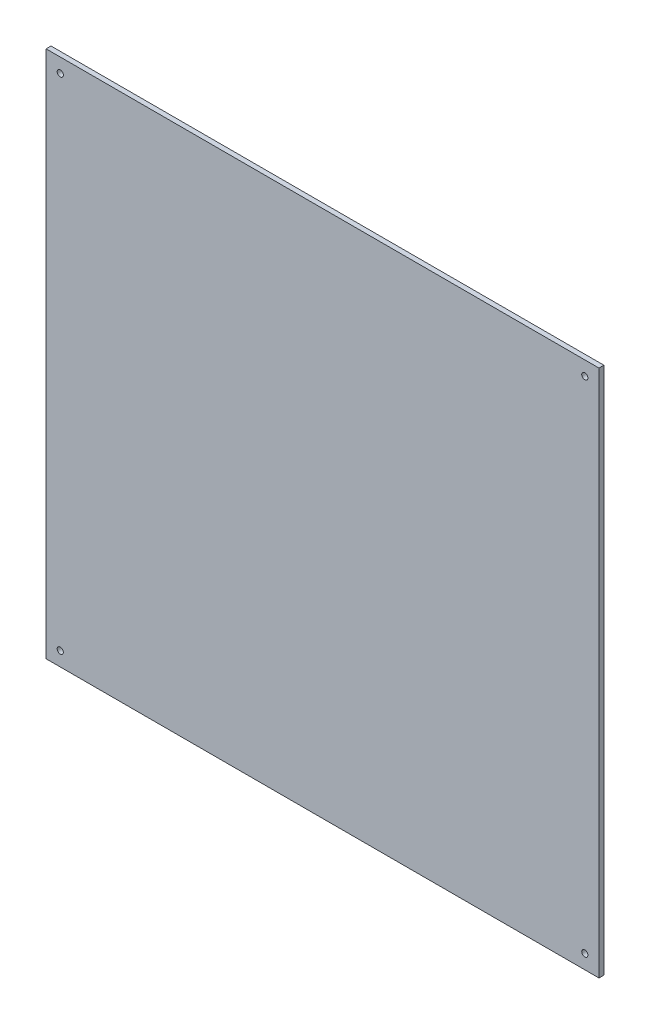
ISO-10303-21;
HEADER;
FILE_DESCRIPTION(('STEP AP214'),'2;1');
FILE_NAME('part.step','',(''),(''),'','','');
FILE_SCHEMA(('AUTOMOTIVE_DESIGN { 1 0 10303 214 1 1 1 1 }'));
ENDSEC;
DATA;
#1=APPLICATION_CONTEXT('core data for automotive mechanical design processes');
#2=APPLICATION_PROTOCOL_DEFINITION('international standard','automotive_design',2000,#1);
#3=PRODUCT_CONTEXT('',#1,'mechanical');
#4=PRODUCT('Part','Part','',(#3));
#5=PRODUCT_RELATED_PRODUCT_CATEGORY('part','',(#4));
#6=PRODUCT_DEFINITION_FORMATION('','',#4);
#7=PRODUCT_DEFINITION_CONTEXT('part definition',#1,'design');
#8=PRODUCT_DEFINITION('design','',#6,#7);
#9=PRODUCT_DEFINITION_SHAPE('','',#8);
#10=(LENGTH_UNIT() NAMED_UNIT(*) SI_UNIT(.MILLI.,.METRE.));
#11=(NAMED_UNIT(*) PLANE_ANGLE_UNIT() SI_UNIT($,.RADIAN.));
#12=(NAMED_UNIT(*) SI_UNIT($,.STERADIAN.) SOLID_ANGLE_UNIT());
#13=UNCERTAINTY_MEASURE_WITH_UNIT(LENGTH_MEASURE(1.E-05),#10,'distance_accuracy_value','');
#14=(GEOMETRIC_REPRESENTATION_CONTEXT(3) GLOBAL_UNCERTAINTY_ASSIGNED_CONTEXT((#13)) GLOBAL_UNIT_ASSIGNED_CONTEXT((#10,
#11,#12)) REPRESENTATION_CONTEXT('',''));
#15=CARTESIAN_POINT('',(0.,0.,0.));
#16=DIRECTION('',(0.,0.,1.));
#17=DIRECTION('',(1.,0.,0.));
#18=AXIS2_PLACEMENT_3D('',#15,#16,#17);
#19=CARTESIAN_POINT('',(0.,0.,4.));
#20=DIRECTION('',(0.,0.,1.));
#21=DIRECTION('',(1.,0.,0.));
#22=AXIS2_PLACEMENT_3D('',#19,#20,#21);
#23=PLANE('',#22);
#24=CARTESIAN_POINT('',(-437.5,11.5000000000001,4.));
#25=DIRECTION('',(0.,0.,1.));
#26=DIRECTION('',(-1.,0.,0.));
#27=AXIS2_PLACEMENT_3D('',#24,#25,#26);
#28=CIRCLE('',#27,2.50000000000002);
#29=CARTESIAN_POINT('',(-440.,11.5000000000001,4.));
#30=VERTEX_POINT('',#29);
#31=EDGE_CURVE('E123',#30,#30,#28,.T.);
#32=ORIENTED_EDGE('',*,*,#31,.F.);
#33=EDGE_LOOP('',(#32));
#34=FACE_BOUND('',#33,.T.);
#35=CARTESIAN_POINT('',(-437.5,417.5,4.));
#36=DIRECTION('',(0.,0.,1.));
#37=DIRECTION('',(1.,0.,0.));
#38=AXIS2_PLACEMENT_3D('',#35,#36,#37);
#39=CIRCLE('',#38,2.50000000000002);
#40=CARTESIAN_POINT('',(-435.,417.5,4.));
#41=VERTEX_POINT('',#40);
#42=EDGE_CURVE('E102',#41,#41,#39,.T.);
#43=ORIENTED_EDGE('',*,*,#42,.F.);
#44=EDGE_LOOP('',(#43));
#45=FACE_BOUND('',#44,.T.);
#46=DIRECTION('',(0.,1.,0.));
#47=VECTOR('',#46,1.);
#48=CARTESIAN_POINT('',(0.,0.,4.));
#49=LINE('',#48,#47);
#50=CARTESIAN_POINT('',(0.,0.,4.));
#51=VERTEX_POINT('',#50);
#52=CARTESIAN_POINT('',(-1.66533453693773E-13,429.,4.));
#53=VERTEX_POINT('',#52);
#54=EDGE_CURVE('E87',#51,#53,#49,.T.);
#55=ORIENTED_EDGE('',*,*,#54,.T.);
#56=DIRECTION('',(-1.,0.,0.));
#57=VECTOR('',#56,1.);
#58=CARTESIAN_POINT('',(-1.66533453693773E-13,429.,4.));
#59=LINE('',#58,#57);
#60=CARTESIAN_POINT('',(-449.,429.,4.));
#61=VERTEX_POINT('',#60);
#62=EDGE_CURVE('E82',#53,#61,#59,.T.);
#63=ORIENTED_EDGE('',*,*,#62,.T.);
#64=DIRECTION('',(0.,-1.,0.));
#65=VECTOR('',#64,1.);
#66=CARTESIAN_POINT('',(-449.,0.,4.));
#67=LINE('',#66,#65);
#68=CARTESIAN_POINT('',(-449.,0.,4.));
#69=VERTEX_POINT('',#68);
#70=EDGE_CURVE('E85',#61,#69,#67,.T.);
#71=ORIENTED_EDGE('',*,*,#70,.T.);
#72=DIRECTION('',(1.,0.,0.));
#73=VECTOR('',#72,1.);
#74=CARTESIAN_POINT('',(0.,0.,4.));
#75=LINE('',#74,#73);
#76=EDGE_CURVE('E52',#69,#51,#75,.T.);
#77=ORIENTED_EDGE('',*,*,#76,.T.);
#78=EDGE_LOOP('',(#55,#63,#71,#77));
#79=FACE_BOUND('',#78,.T.);
#80=CARTESIAN_POINT('',(-11.5000000000001,417.5,4.));
#81=DIRECTION('',(0.,0.,1.));
#82=DIRECTION('',(-1.,0.,0.));
#83=AXIS2_PLACEMENT_3D('',#80,#81,#82);
#84=CIRCLE('',#83,2.50000000000002);
#85=CARTESIAN_POINT('',(-14.0000000000001,417.5,4.));
#86=VERTEX_POINT('',#85);
#87=EDGE_CURVE('E117',#86,#86,#84,.T.);
#88=ORIENTED_EDGE('',*,*,#87,.F.);
#89=EDGE_LOOP('',(#88));
#90=FACE_BOUND('',#89,.T.);
#91=CARTESIAN_POINT('',(-11.5000000000001,11.5000000000002,4.));
#92=DIRECTION('',(0.,0.,1.));
#93=DIRECTION('',(1.,0.,0.));
#94=AXIS2_PLACEMENT_3D('',#91,#92,#93);
#95=CIRCLE('',#94,2.50000000000002);
#96=CARTESIAN_POINT('',(-9.0000000000001,11.5000000000002,4.));
#97=VERTEX_POINT('',#96);
#98=EDGE_CURVE('E129',#97,#97,#95,.T.);
#99=ORIENTED_EDGE('',*,*,#98,.F.);
#100=EDGE_LOOP('',(#99));
#101=FACE_BOUND('',#100,.T.);
#102=ADVANCED_FACE('F35',(#34,#45,#79,#90,#101),#23,.T.);
#103=CARTESIAN_POINT('',(0.,0.,0.));
#104=DIRECTION('',(0.,0.,1.));
#105=DIRECTION('',(1.,0.,0.));
#106=AXIS2_PLACEMENT_3D('',#103,#104,#105);
#107=PLANE('',#106);
#108=DIRECTION('',(0.,1.,0.));
#109=VECTOR('',#108,1.);
#110=CARTESIAN_POINT('',(0.,0.,0.));
#111=LINE('',#110,#109);
#112=CARTESIAN_POINT('',(0.,0.,0.));
#113=VERTEX_POINT('',#112);
#114=CARTESIAN_POINT('',(-1.66533453693773E-13,429.,0.));
#115=VERTEX_POINT('',#114);
#116=EDGE_CURVE('E99',#113,#115,#111,.T.);
#117=ORIENTED_EDGE('',*,*,#116,.F.);
#118=DIRECTION('',(1.,0.,0.));
#119=VECTOR('',#118,1.);
#120=CARTESIAN_POINT('',(0.,0.,0.));
#121=LINE('',#120,#119);
#122=CARTESIAN_POINT('',(-449.,0.,0.));
#123=VERTEX_POINT('',#122);
#124=EDGE_CURVE('E75',#123,#113,#121,.T.);
#125=ORIENTED_EDGE('',*,*,#124,.F.);
#126=DIRECTION('',(0.,-1.,0.));
#127=VECTOR('',#126,1.);
#128=CARTESIAN_POINT('',(-449.,0.,0.));
#129=LINE('',#128,#127);
#130=CARTESIAN_POINT('',(-449.,429.,0.));
#131=VERTEX_POINT('',#130);
#132=EDGE_CURVE('E69',#131,#123,#129,.T.);
#133=ORIENTED_EDGE('',*,*,#132,.F.);
#134=DIRECTION('',(-1.,0.,0.));
#135=VECTOR('',#134,1.);
#136=CARTESIAN_POINT('',(-1.66533453693773E-13,429.,0.));
#137=LINE('',#136,#135);
#138=EDGE_CURVE('E91',#115,#131,#137,.T.);
#139=ORIENTED_EDGE('',*,*,#138,.F.);
#140=EDGE_LOOP('',(#117,#125,#133,#139));
#141=FACE_BOUND('',#140,.T.);
#142=CARTESIAN_POINT('',(-437.5,417.5,0.));
#143=DIRECTION('',(0.,0.,1.));
#144=DIRECTION('',(1.,0.,0.));
#145=AXIS2_PLACEMENT_3D('',#142,#143,#144);
#146=CIRCLE('',#145,2.50000000000002);
#147=CARTESIAN_POINT('',(-435.,417.5,0.));
#148=VERTEX_POINT('',#147);
#149=EDGE_CURVE('E114',#148,#148,#146,.T.);
#150=ORIENTED_EDGE('',*,*,#149,.T.);
#151=EDGE_LOOP('',(#150));
#152=FACE_BOUND('',#151,.T.);
#153=CARTESIAN_POINT('',(-11.5000000000001,417.5,0.));
#154=DIRECTION('',(0.,0.,1.));
#155=DIRECTION('',(-1.,0.,0.));
#156=AXIS2_PLACEMENT_3D('',#153,#154,#155);
#157=CIRCLE('',#156,2.50000000000002);
#158=CARTESIAN_POINT('',(-14.0000000000001,417.5,0.));
#159=VERTEX_POINT('',#158);
#160=EDGE_CURVE('E120',#159,#159,#157,.T.);
#161=ORIENTED_EDGE('',*,*,#160,.T.);
#162=EDGE_LOOP('',(#161));
#163=FACE_BOUND('',#162,.T.);
#164=CARTESIAN_POINT('',(-437.5,11.5000000000001,0.));
#165=DIRECTION('',(0.,0.,1.));
#166=DIRECTION('',(-1.,0.,0.));
#167=AXIS2_PLACEMENT_3D('',#164,#165,#166);
#168=CIRCLE('',#167,2.50000000000002);
#169=CARTESIAN_POINT('',(-440.,11.5000000000001,0.));
#170=VERTEX_POINT('',#169);
#171=EDGE_CURVE('E126',#170,#170,#168,.T.);
#172=ORIENTED_EDGE('',*,*,#171,.T.);
#173=EDGE_LOOP('',(#172));
#174=FACE_BOUND('',#173,.T.);
#175=CARTESIAN_POINT('',(-11.5000000000001,11.5000000000002,0.));
#176=DIRECTION('',(0.,0.,1.));
#177=DIRECTION('',(1.,0.,0.));
#178=AXIS2_PLACEMENT_3D('',#175,#176,#177);
#179=CIRCLE('',#178,2.50000000000002);
#180=CARTESIAN_POINT('',(-9.0000000000001,11.5000000000002,0.));
#181=VERTEX_POINT('',#180);
#182=EDGE_CURVE('E132',#181,#181,#179,.T.);
#183=ORIENTED_EDGE('',*,*,#182,.T.);
#184=EDGE_LOOP('',(#183));
#185=FACE_BOUND('',#184,.T.);
#186=ADVANCED_FACE('F110',(#141,#152,#163,#174,#185),#107,.F.);
#187=CARTESIAN_POINT('',(0.,0.,4.));
#188=DIRECTION('',(-1.,0.,0.));
#189=DIRECTION('',(0.,-1.,0.));
#190=AXIS2_PLACEMENT_3D('',#187,#188,#189);
#191=PLANE('',#190);
#192=ORIENTED_EDGE('',*,*,#116,.T.);
#193=DIRECTION('',(0.,0.,-1.));
#194=VECTOR('',#193,1.);
#195=CARTESIAN_POINT('',(-1.66533453693773E-13,429.,4.));
#196=LINE('',#195,#194);
#197=EDGE_CURVE('E11',#53,#115,#196,.T.);
#198=ORIENTED_EDGE('',*,*,#197,.F.);
#199=ORIENTED_EDGE('',*,*,#54,.F.);
#200=DIRECTION('',(0.,0.,-1.));
#201=VECTOR('',#200,1.);
#202=CARTESIAN_POINT('',(0.,0.,4.));
#203=LINE('',#202,#201);
#204=EDGE_CURVE('E95',#51,#113,#203,.T.);
#205=ORIENTED_EDGE('',*,*,#204,.T.);
#206=EDGE_LOOP('',(#192,#198,#199,#205));
#207=FACE_BOUND('',#206,.T.);
#208=ADVANCED_FACE('F37',(#207),#191,.F.);
#209=CARTESIAN_POINT('',(-1.66533453693773E-13,429.,4.));
#210=DIRECTION('',(0.,-1.,0.));
#211=DIRECTION('',(1.,0.,0.));
#212=AXIS2_PLACEMENT_3D('',#209,#210,#211);
#213=PLANE('',#212);
#214=ORIENTED_EDGE('',*,*,#138,.T.);
#215=DIRECTION('',(0.,0.,-1.));
#216=VECTOR('',#215,1.);
#217=CARTESIAN_POINT('',(-449.,429.,4.));
#218=LINE('',#217,#216);
#219=EDGE_CURVE('E44',#61,#131,#218,.T.);
#220=ORIENTED_EDGE('',*,*,#219,.F.);
#221=ORIENTED_EDGE('',*,*,#62,.F.);
#222=ORIENTED_EDGE('',*,*,#197,.T.);
#223=EDGE_LOOP('',(#214,#220,#221,#222));
#224=FACE_BOUND('',#223,.T.);
#225=ADVANCED_FACE('F90',(#224),#213,.F.);
#226=CARTESIAN_POINT('',(-449.,0.,4.));
#227=DIRECTION('',(1.,0.,0.));
#228=DIRECTION('',(0.,1.,0.));
#229=AXIS2_PLACEMENT_3D('',#226,#227,#228);
#230=PLANE('',#229);
#231=ORIENTED_EDGE('',*,*,#132,.T.);
#232=DIRECTION('',(0.,0.,-1.));
#233=VECTOR('',#232,1.);
#234=CARTESIAN_POINT('',(-449.,0.,4.));
#235=LINE('',#234,#233);
#236=EDGE_CURVE('E92',#69,#123,#235,.T.);
#237=ORIENTED_EDGE('',*,*,#236,.F.);
#238=ORIENTED_EDGE('',*,*,#70,.F.);
#239=ORIENTED_EDGE('',*,*,#219,.T.);
#240=EDGE_LOOP('',(#231,#237,#238,#239));
#241=FACE_BOUND('',#240,.T.);
#242=ADVANCED_FACE('F93',(#241),#230,.F.);
#243=CARTESIAN_POINT('',(0.,0.,4.));
#244=DIRECTION('',(0.,1.,0.));
#245=DIRECTION('',(-1.,0.,0.));
#246=AXIS2_PLACEMENT_3D('',#243,#244,#245);
#247=PLANE('',#246);
#248=ORIENTED_EDGE('',*,*,#124,.T.);
#249=ORIENTED_EDGE('',*,*,#204,.F.);
#250=ORIENTED_EDGE('',*,*,#76,.F.);
#251=ORIENTED_EDGE('',*,*,#236,.T.);
#252=EDGE_LOOP('',(#248,#249,#250,#251));
#253=FACE_BOUND('',#252,.T.);
#254=ADVANCED_FACE('F107',(#253),#247,.F.);
#255=CARTESIAN_POINT('',(-437.5,417.5,4.));
#256=DIRECTION('',(0.,0.,-1.));
#257=DIRECTION('',(-1.,0.,0.));
#258=AXIS2_PLACEMENT_3D('',#255,#256,#257);
#259=CYLINDRICAL_SURFACE('',#258,2.50000000000002);
#260=ORIENTED_EDGE('',*,*,#42,.T.);
#261=EDGE_LOOP('',(#260));
#262=FACE_BOUND('',#261,.T.);
#263=ORIENTED_EDGE('',*,*,#149,.F.);
#264=EDGE_LOOP('',(#263));
#265=FACE_BOUND('',#264,.T.);
#266=ADVANCED_FACE('F151',(#262,#265),#259,.F.);
#267=CARTESIAN_POINT('',(-11.5000000000001,417.5,4.));
#268=DIRECTION('',(0.,0.,-1.));
#269=DIRECTION('',(-1.,0.,0.));
#270=AXIS2_PLACEMENT_3D('',#267,#268,#269);
#271=CYLINDRICAL_SURFACE('',#270,2.50000000000002);
#272=ORIENTED_EDGE('',*,*,#87,.T.);
#273=EDGE_LOOP('',(#272));
#274=FACE_BOUND('',#273,.T.);
#275=ORIENTED_EDGE('',*,*,#160,.F.);
#276=EDGE_LOOP('',(#275));
#277=FACE_BOUND('',#276,.T.);
#278=ADVANCED_FACE('F199',(#274,#277),#271,.F.);
#279=CARTESIAN_POINT('',(-437.5,11.5000000000001,4.));
#280=DIRECTION('',(0.,0.,-1.));
#281=DIRECTION('',(-1.,0.,0.));
#282=AXIS2_PLACEMENT_3D('',#279,#280,#281);
#283=CYLINDRICAL_SURFACE('',#282,2.50000000000002);
#284=ORIENTED_EDGE('',*,*,#31,.T.);
#285=EDGE_LOOP('',(#284));
#286=FACE_BOUND('',#285,.T.);
#287=ORIENTED_EDGE('',*,*,#171,.F.);
#288=EDGE_LOOP('',(#287));
#289=FACE_BOUND('',#288,.T.);
#290=ADVANCED_FACE('F207',(#286,#289),#283,.F.);
#291=CARTESIAN_POINT('',(-11.5000000000001,11.5000000000002,4.));
#292=DIRECTION('',(0.,0.,-1.));
#293=DIRECTION('',(-1.,0.,0.));
#294=AXIS2_PLACEMENT_3D('',#291,#292,#293);
#295=CYLINDRICAL_SURFACE('',#294,2.50000000000002);
#296=ORIENTED_EDGE('',*,*,#98,.T.);
#297=EDGE_LOOP('',(#296));
#298=FACE_BOUND('',#297,.T.);
#299=ORIENTED_EDGE('',*,*,#182,.F.);
#300=EDGE_LOOP('',(#299));
#301=FACE_BOUND('',#300,.T.);
#302=ADVANCED_FACE('F138',(#298,#301),#295,.F.);
#303=CLOSED_SHELL('',(#102,#186,#208,#225,#242,#254,#266,#278,#290,#302));
#304=MANIFOLD_SOLID_BREP('B2',#303);
#305=ADVANCED_BREP_SHAPE_REPRESENTATION('',(#18,#304),#14);
#306=SHAPE_DEFINITION_REPRESENTATION(#9,#305);
ENDSEC;
END-ISO-10303-21;
